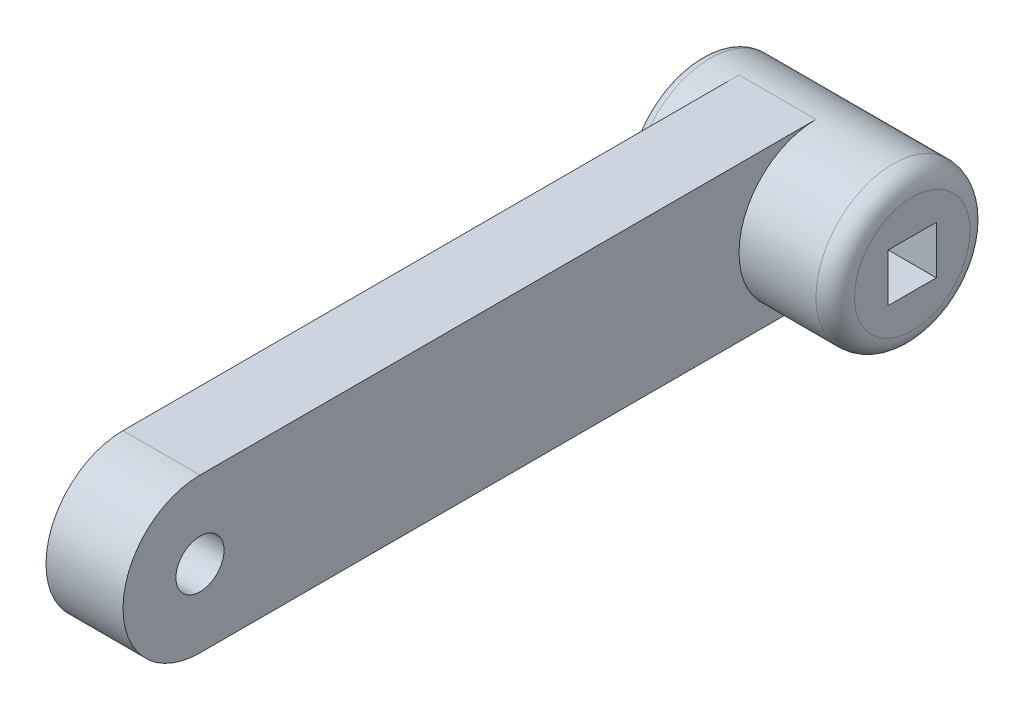
ISO-10303-21;
HEADER;
FILE_DESCRIPTION(('STEP AP214'),'2;1');
FILE_NAME('part.step','',(''),(''),'','','');
FILE_SCHEMA(('AUTOMOTIVE_DESIGN { 1 0 10303 214 1 1 1 1 }'));
ENDSEC;
DATA;
#1=APPLICATION_CONTEXT('core data for automotive mechanical design processes');
#2=APPLICATION_PROTOCOL_DEFINITION('international standard','automotive_design',2000,#1);
#3=PRODUCT_CONTEXT('',#1,'mechanical');
#4=PRODUCT('Part','Part','',(#3));
#5=PRODUCT_RELATED_PRODUCT_CATEGORY('part','',(#4));
#6=PRODUCT_DEFINITION_FORMATION('','',#4);
#7=PRODUCT_DEFINITION_CONTEXT('part definition',#1,'design');
#8=PRODUCT_DEFINITION('design','',#6,#7);
#9=PRODUCT_DEFINITION_SHAPE('','',#8);
#10=(LENGTH_UNIT() NAMED_UNIT(*) SI_UNIT(.MILLI.,.METRE.));
#11=(NAMED_UNIT(*) PLANE_ANGLE_UNIT() SI_UNIT($,.RADIAN.));
#12=(NAMED_UNIT(*) SI_UNIT($,.STERADIAN.) SOLID_ANGLE_UNIT());
#13=UNCERTAINTY_MEASURE_WITH_UNIT(LENGTH_MEASURE(1.E-05),#10,'distance_accuracy_value','');
#14=(GEOMETRIC_REPRESENTATION_CONTEXT(3) GLOBAL_UNCERTAINTY_ASSIGNED_CONTEXT((#13)) GLOBAL_UNIT_ASSIGNED_CONTEXT((#10,
#11,#12)) REPRESENTATION_CONTEXT('',''));
#15=CARTESIAN_POINT('',(0.,0.,0.));
#16=DIRECTION('',(0.,0.,1.));
#17=DIRECTION('',(1.,0.,0.));
#18=AXIS2_PLACEMENT_3D('',#15,#16,#17);
#19=CARTESIAN_POINT('',(10.16,0.,0.));
#20=DIRECTION('',(-1.,0.,0.));
#21=DIRECTION('',(0.,0.,1.));
#22=AXIS2_PLACEMENT_3D('',#19,#20,#21);
#23=CYLINDRICAL_SURFACE('',#22,10.16);
#24=CARTESIAN_POINT('',(15.24,0.,0.));
#25=DIRECTION('',(1.,0.,0.));
#26=DIRECTION('',(0.,0.,-1.));
#27=AXIS2_PLACEMENT_3D('',#24,#25,#26);
#28=CIRCLE('',#27,10.16);
#29=CARTESIAN_POINT('',(15.24,0.,-10.16));
#30=VERTEX_POINT('',#29);
#31=EDGE_CURVE('E11',#30,#30,#28,.F.);
#32=ORIENTED_EDGE('',*,*,#31,.T.);
#33=EDGE_LOOP('',(#32));
#34=FACE_BOUND('',#33,.T.);
#35=CARTESIAN_POINT('',(5.08,0.,0.));
#36=DIRECTION('',(1.,0.,0.));
#37=DIRECTION('',(0.,0.,-1.));
#38=AXIS2_PLACEMENT_3D('',#35,#36,#37);
#39=CIRCLE('',#38,10.16);
#40=CARTESIAN_POINT('',(5.08,10.16,0.));
#41=VERTEX_POINT('',#40);
#42=CARTESIAN_POINT('',(5.08,-10.16,0.));
#43=VERTEX_POINT('',#42);
#44=EDGE_CURVE('E56',#41,#43,#39,.T.);
#45=ORIENTED_EDGE('',*,*,#44,.T.);
#46=DIRECTION('',(-1.,0.,0.));
#47=VECTOR('',#46,1.);
#48=CARTESIAN_POINT('',(5.08,-10.16,0.));
#49=LINE('',#48,#47);
#50=CARTESIAN_POINT('',(-5.08,-10.16,0.));
#51=VERTEX_POINT('',#50);
#52=EDGE_CURVE('E159',#43,#51,#49,.T.);
#53=ORIENTED_EDGE('',*,*,#52,.T.);
#54=CARTESIAN_POINT('',(-5.08,0.,0.));
#55=DIRECTION('',(1.,0.,0.));
#56=DIRECTION('',(0.,0.,-1.));
#57=AXIS2_PLACEMENT_3D('',#54,#55,#56);
#58=CIRCLE('',#57,10.16);
#59=CARTESIAN_POINT('',(-5.08,10.16,0.));
#60=VERTEX_POINT('',#59);
#61=EDGE_CURVE('E170',#60,#51,#58,.T.);
#62=ORIENTED_EDGE('',*,*,#61,.F.);
#63=DIRECTION('',(-1.,0.,0.));
#64=VECTOR('',#63,1.);
#65=CARTESIAN_POINT('',(5.08,10.16,0.));
#66=LINE('',#65,#64);
#67=EDGE_CURVE('E156',#41,#60,#66,.T.);
#68=ORIENTED_EDGE('',*,*,#67,.F.);
#69=EDGE_LOOP('',(#45,#53,#62,#68));
#70=FACE_BOUND('',#69,.T.);
#71=CARTESIAN_POINT('',(-8.89,0.,0.));
#72=DIRECTION('',(1.,0.,0.));
#73=DIRECTION('',(0.,0.,-1.));
#74=AXIS2_PLACEMENT_3D('',#71,#72,#73);
#75=CIRCLE('',#74,10.16);
#76=CARTESIAN_POINT('',(-8.89,0.,-10.16));
#77=VERTEX_POINT('',#76);
#78=EDGE_CURVE('E164',#77,#77,#75,.T.);
#79=ORIENTED_EDGE('',*,*,#78,.T.);
#80=EDGE_LOOP('',(#79));
#81=FACE_BOUND('',#80,.T.);
#82=ADVANCED_FACE('F32',(#34,#70,#81),#23,.T.);
#83=CARTESIAN_POINT('',(-10.16,0.,0.));
#84=DIRECTION('',(1.,0.,0.));
#85=DIRECTION('',(0.,0.,-1.));
#86=AXIS2_PLACEMENT_3D('',#83,#84,#85);
#87=PLANE('',#86);
#88=CARTESIAN_POINT('',(-10.16,0.,0.));
#89=DIRECTION('',(1.,0.,0.));
#90=DIRECTION('',(0.,0.,-1.));
#91=AXIS2_PLACEMENT_3D('',#88,#89,#90);
#92=CIRCLE('',#91,8.89);
#93=CARTESIAN_POINT('',(-10.16,0.,-8.89));
#94=VERTEX_POINT('',#93);
#95=EDGE_CURVE('E167',#94,#94,#92,.F.);
#96=ORIENTED_EDGE('',*,*,#95,.T.);
#97=EDGE_LOOP('',(#96));
#98=FACE_BOUND('',#97,.T.);
#99=ADVANCED_FACE('F192',(#98),#87,.F.);
#100=CARTESIAN_POINT('',(-8.89,0.,0.));
#101=DIRECTION('',(1.,0.,0.));
#102=DIRECTION('',(0.,0.,-1.));
#103=AXIS2_PLACEMENT_3D('',#100,#101,#102);
#104=TOROIDAL_SURFACE('',#103,8.89,1.27);
#105=ORIENTED_EDGE('',*,*,#95,.F.);
#106=EDGE_LOOP('',(#105));
#107=FACE_BOUND('',#106,.T.);
#108=ORIENTED_EDGE('',*,*,#78,.F.);
#109=EDGE_LOOP('',(#108));
#110=FACE_BOUND('',#109,.T.);
#111=ADVANCED_FACE('F198',(#107,#110),#104,.T.);
#112=CARTESIAN_POINT('',(5.08,0.,81.28));
#113=DIRECTION('',(1.,0.,0.));
#114=DIRECTION('',(0.,0.,-1.));
#115=AXIS2_PLACEMENT_3D('',#112,#113,#114);
#116=PLANE('',#115);
#117=CARTESIAN_POINT('',(5.08,0.,81.28));
#118=DIRECTION('',(1.,0.,0.));
#119=DIRECTION('',(0.,0.,-1.));
#120=AXIS2_PLACEMENT_3D('',#117,#118,#119);
#121=CIRCLE('',#120,3.175);
#122=CARTESIAN_POINT('',(5.08,0.,78.105));
#123=VERTEX_POINT('',#122);
#124=EDGE_CURVE('E124',#123,#123,#121,.T.);
#125=ORIENTED_EDGE('',*,*,#124,.F.);
#126=EDGE_LOOP('',(#125));
#127=FACE_BOUND('',#126,.T.);
#128=ORIENTED_EDGE('',*,*,#44,.F.);
#129=DIRECTION('',(0.,0.,1.));
#130=VECTOR('',#129,1.);
#131=CARTESIAN_POINT('',(5.08,10.16,81.28));
#132=LINE('',#131,#130);
#133=CARTESIAN_POINT('',(5.08,10.16,81.28));
#134=VERTEX_POINT('',#133);
#135=EDGE_CURVE('E145',#41,#134,#132,.T.);
#136=ORIENTED_EDGE('',*,*,#135,.T.);
#137=CARTESIAN_POINT('',(5.08,0.,81.28));
#138=DIRECTION('',(1.,0.,0.));
#139=DIRECTION('',(0.,0.,-1.));
#140=AXIS2_PLACEMENT_3D('',#137,#138,#139);
#141=CIRCLE('',#140,10.16);
#142=CARTESIAN_POINT('',(5.08,-10.16,81.28));
#143=VERTEX_POINT('',#142);
#144=EDGE_CURVE('E139',#134,#143,#141,.T.);
#145=ORIENTED_EDGE('',*,*,#144,.T.);
#146=DIRECTION('',(0.,0.,-1.));
#147=VECTOR('',#146,1.);
#148=CARTESIAN_POINT('',(5.08,-10.16,81.28));
#149=LINE('',#148,#147);
#150=EDGE_CURVE('E142',#143,#43,#149,.T.);
#151=ORIENTED_EDGE('',*,*,#150,.T.);
#152=EDGE_LOOP('',(#128,#136,#145,#151));
#153=FACE_BOUND('',#152,.T.);
#154=ADVANCED_FACE('F203',(#127,#153),#116,.T.);
#155=CARTESIAN_POINT('',(-5.08,0.,81.28));
#156=DIRECTION('',(1.,0.,0.));
#157=DIRECTION('',(0.,0.,-1.));
#158=AXIS2_PLACEMENT_3D('',#155,#156,#157);
#159=PLANE('',#158);
#160=CARTESIAN_POINT('',(-5.08,0.,81.28));
#161=DIRECTION('',(1.,0.,0.));
#162=DIRECTION('',(0.,0.,-1.));
#163=AXIS2_PLACEMENT_3D('',#160,#161,#162);
#164=CIRCLE('',#163,3.175);
#165=CARTESIAN_POINT('',(-5.08,0.,78.105));
#166=VERTEX_POINT('',#165);
#167=EDGE_CURVE('E36',#166,#166,#164,.T.);
#168=ORIENTED_EDGE('',*,*,#167,.T.);
#169=EDGE_LOOP('',(#168));
#170=FACE_BOUND('',#169,.T.);
#171=DIRECTION('',(0.,0.,1.));
#172=VECTOR('',#171,1.);
#173=CARTESIAN_POINT('',(-5.08,10.16,81.28));
#174=LINE('',#173,#172);
#175=CARTESIAN_POINT('',(-5.08,10.16,81.28));
#176=VERTEX_POINT('',#175);
#177=EDGE_CURVE('E143',#60,#176,#174,.T.);
#178=ORIENTED_EDGE('',*,*,#177,.F.);
#179=ORIENTED_EDGE('',*,*,#61,.T.);
#180=DIRECTION('',(0.,0.,-1.));
#181=VECTOR('',#180,1.);
#182=CARTESIAN_POINT('',(-5.08,-10.16,81.28));
#183=LINE('',#182,#181);
#184=CARTESIAN_POINT('',(-5.08,-10.16,81.28));
#185=VERTEX_POINT('',#184);
#186=EDGE_CURVE('E150',#185,#51,#183,.T.);
#187=ORIENTED_EDGE('',*,*,#186,.F.);
#188=CARTESIAN_POINT('',(-5.08,0.,81.28));
#189=DIRECTION('',(1.,0.,0.));
#190=DIRECTION('',(0.,0.,-1.));
#191=AXIS2_PLACEMENT_3D('',#188,#189,#190);
#192=CIRCLE('',#191,10.16);
#193=EDGE_CURVE('E135',#176,#185,#192,.T.);
#194=ORIENTED_EDGE('',*,*,#193,.F.);
#195=EDGE_LOOP('',(#178,#179,#187,#194));
#196=FACE_BOUND('',#195,.T.);
#197=ADVANCED_FACE('F208',(#170,#196),#159,.F.);
#198=CARTESIAN_POINT('',(5.08,0.,81.28));
#199=DIRECTION('',(-1.,0.,0.));
#200=DIRECTION('',(0.,0.,1.));
#201=AXIS2_PLACEMENT_3D('',#198,#199,#200);
#202=CYLINDRICAL_SURFACE('',#201,10.16);
#203=ORIENTED_EDGE('',*,*,#193,.T.);
#204=DIRECTION('',(-1.,0.,0.));
#205=VECTOR('',#204,1.);
#206=CARTESIAN_POINT('',(5.08,-10.16,81.28));
#207=LINE('',#206,#205);
#208=EDGE_CURVE('E161',#143,#185,#207,.T.);
#209=ORIENTED_EDGE('',*,*,#208,.F.);
#210=ORIENTED_EDGE('',*,*,#144,.F.);
#211=DIRECTION('',(-1.,0.,0.));
#212=VECTOR('',#211,1.);
#213=CARTESIAN_POINT('',(5.08,10.16,81.28));
#214=LINE('',#213,#212);
#215=EDGE_CURVE('E147',#134,#176,#214,.T.);
#216=ORIENTED_EDGE('',*,*,#215,.T.);
#217=EDGE_LOOP('',(#203,#209,#210,#216));
#218=FACE_BOUND('',#217,.T.);
#219=ADVANCED_FACE('F218',(#218),#202,.T.);
#220=CARTESIAN_POINT('',(5.08,-10.16,81.28));
#221=DIRECTION('',(0.,1.,0.));
#222=DIRECTION('',(0.,0.,1.));
#223=AXIS2_PLACEMENT_3D('',#220,#221,#222);
#224=PLANE('',#223);
#225=ORIENTED_EDGE('',*,*,#186,.T.);
#226=ORIENTED_EDGE('',*,*,#52,.F.);
#227=ORIENTED_EDGE('',*,*,#150,.F.);
#228=ORIENTED_EDGE('',*,*,#208,.T.);
#229=EDGE_LOOP('',(#225,#226,#227,#228));
#230=FACE_BOUND('',#229,.T.);
#231=ADVANCED_FACE('F226',(#230),#224,.F.);
#232=CARTESIAN_POINT('',(5.08,10.16,81.28));
#233=DIRECTION('',(0.,-1.,0.));
#234=DIRECTION('',(0.,0.,-1.));
#235=AXIS2_PLACEMENT_3D('',#232,#233,#234);
#236=PLANE('',#235);
#237=ORIENTED_EDGE('',*,*,#177,.T.);
#238=ORIENTED_EDGE('',*,*,#215,.F.);
#239=ORIENTED_EDGE('',*,*,#135,.F.);
#240=ORIENTED_EDGE('',*,*,#67,.T.);
#241=EDGE_LOOP('',(#237,#238,#239,#240));
#242=FACE_BOUND('',#241,.T.);
#243=ADVANCED_FACE('F187',(#242),#236,.F.);
#244=CARTESIAN_POINT('',(17.78,0.,0.));
#245=DIRECTION('',(1.,0.,0.));
#246=DIRECTION('',(0.,0.,-1.));
#247=AXIS2_PLACEMENT_3D('',#244,#245,#246);
#248=PLANE('',#247);
#249=DIRECTION('',(0.,1.,0.));
#250=VECTOR('',#249,1.);
#251=CARTESIAN_POINT('',(17.78,3.175,-3.175));
#252=LINE('',#251,#250);
#253=CARTESIAN_POINT('',(17.78,-3.175,-3.175));
#254=VERTEX_POINT('',#253);
#255=CARTESIAN_POINT('',(17.78,3.175,-3.175));
#256=VERTEX_POINT('',#255);
#257=EDGE_CURVE('E48',#254,#256,#252,.T.);
#258=ORIENTED_EDGE('',*,*,#257,.F.);
#259=DIRECTION('',(0.,0.,-1.));
#260=VECTOR('',#259,1.);
#261=CARTESIAN_POINT('',(17.78,-3.175,3.175));
#262=LINE('',#261,#260);
#263=CARTESIAN_POINT('',(17.78,-3.175,3.175));
#264=VERTEX_POINT('',#263);
#265=EDGE_CURVE('E118',#264,#254,#262,.T.);
#266=ORIENTED_EDGE('',*,*,#265,.F.);
#267=DIRECTION('',(0.,-1.,0.));
#268=VECTOR('',#267,1.);
#269=CARTESIAN_POINT('',(17.78,3.175,3.175));
#270=LINE('',#269,#268);
#271=CARTESIAN_POINT('',(17.78,3.175,3.175));
#272=VERTEX_POINT('',#271);
#273=EDGE_CURVE('E121',#272,#264,#270,.T.);
#274=ORIENTED_EDGE('',*,*,#273,.F.);
#275=DIRECTION('',(0.,0.,1.));
#276=VECTOR('',#275,1.);
#277=CARTESIAN_POINT('',(17.78,3.175,3.175));
#278=LINE('',#277,#276);
#279=EDGE_CURVE('E129',#256,#272,#278,.T.);
#280=ORIENTED_EDGE('',*,*,#279,.F.);
#281=EDGE_LOOP('',(#258,#266,#274,#280));
#282=FACE_BOUND('',#281,.T.);
#283=CARTESIAN_POINT('',(17.78,0.,0.));
#284=DIRECTION('',(1.,0.,0.));
#285=DIRECTION('',(0.,0.,-1.));
#286=AXIS2_PLACEMENT_3D('',#283,#284,#285);
#287=CIRCLE('',#286,7.62);
#288=CARTESIAN_POINT('',(17.78,0.,-7.62));
#289=VERTEX_POINT('',#288);
#290=EDGE_CURVE('E41',#289,#289,#287,.T.);
#291=ORIENTED_EDGE('',*,*,#290,.T.);
#292=EDGE_LOOP('',(#291));
#293=FACE_BOUND('',#292,.T.);
#294=ADVANCED_FACE('F177',(#282,#293),#248,.T.);
#295=CARTESIAN_POINT('',(15.24,0.,0.));
#296=DIRECTION('',(1.,0.,0.));
#297=DIRECTION('',(0.,0.,-1.));
#298=AXIS2_PLACEMENT_3D('',#295,#296,#297);
#299=TOROIDAL_SURFACE('',#298,7.62,2.54);
#300=ORIENTED_EDGE('',*,*,#31,.F.);
#301=EDGE_LOOP('',(#300));
#302=FACE_BOUND('',#301,.T.);
#303=ORIENTED_EDGE('',*,*,#290,.F.);
#304=EDGE_LOOP('',(#303));
#305=FACE_BOUND('',#304,.T.);
#306=ADVANCED_FACE('F34',(#302,#305),#299,.T.);
#307=CARTESIAN_POINT('',(-7.62,3.175,-3.175));
#308=DIRECTION('',(0.,0.,-1.));
#309=DIRECTION('',(0.,1.,0.));
#310=AXIS2_PLACEMENT_3D('',#307,#308,#309);
#311=PLANE('',#310);
#312=ORIENTED_EDGE('',*,*,#257,.T.);
#313=DIRECTION('',(1.,0.,0.));
#314=VECTOR('',#313,1.);
#315=CARTESIAN_POINT('',(-7.62,3.175,-3.175));
#316=LINE('',#315,#314);
#317=CARTESIAN_POINT('',(-7.62,3.175,-3.175));
#318=VERTEX_POINT('',#317);
#319=EDGE_CURVE('E96',#318,#256,#316,.T.);
#320=ORIENTED_EDGE('',*,*,#319,.F.);
#321=DIRECTION('',(0.,1.,0.));
#322=VECTOR('',#321,1.);
#323=CARTESIAN_POINT('',(-7.62,3.175,-3.175));
#324=LINE('',#323,#322);
#325=CARTESIAN_POINT('',(-7.62,-3.175,-3.175));
#326=VERTEX_POINT('',#325);
#327=EDGE_CURVE('E100',#326,#318,#324,.T.);
#328=ORIENTED_EDGE('',*,*,#327,.F.);
#329=DIRECTION('',(1.,0.,0.));
#330=VECTOR('',#329,1.);
#331=CARTESIAN_POINT('',(-7.62,-3.175,-3.175));
#332=LINE('',#331,#330);
#333=EDGE_CURVE('E133',#326,#254,#332,.T.);
#334=ORIENTED_EDGE('',*,*,#333,.T.);
#335=EDGE_LOOP('',(#312,#320,#328,#334));
#336=FACE_BOUND('',#335,.T.);
#337=ADVANCED_FACE('F98',(#336),#311,.F.);
#338=CARTESIAN_POINT('',(-7.62,-3.175,3.175));
#339=DIRECTION('',(0.,-1.,0.));
#340=DIRECTION('',(0.,0.,-1.));
#341=AXIS2_PLACEMENT_3D('',#338,#339,#340);
#342=PLANE('',#341);
#343=ORIENTED_EDGE('',*,*,#265,.T.);
#344=ORIENTED_EDGE('',*,*,#333,.F.);
#345=DIRECTION('',(0.,0.,-1.));
#346=VECTOR('',#345,1.);
#347=CARTESIAN_POINT('',(-7.62,-3.175,3.175));
#348=LINE('',#347,#346);
#349=CARTESIAN_POINT('',(-7.62,-3.175,3.175));
#350=VERTEX_POINT('',#349);
#351=EDGE_CURVE('E106',#350,#326,#348,.T.);
#352=ORIENTED_EDGE('',*,*,#351,.F.);
#353=DIRECTION('',(1.,0.,0.));
#354=VECTOR('',#353,1.);
#355=CARTESIAN_POINT('',(-7.62,-3.175,3.175));
#356=LINE('',#355,#354);
#357=EDGE_CURVE('E136',#350,#264,#356,.T.);
#358=ORIENTED_EDGE('',*,*,#357,.T.);
#359=EDGE_LOOP('',(#343,#344,#352,#358));
#360=FACE_BOUND('',#359,.T.);
#361=ADVANCED_FACE('F185',(#360),#342,.F.);
#362=CARTESIAN_POINT('',(-7.62,3.175,3.175));
#363=DIRECTION('',(0.,0.,1.));
#364=DIRECTION('',(0.,-1.,0.));
#365=AXIS2_PLACEMENT_3D('',#362,#363,#364);
#366=PLANE('',#365);
#367=ORIENTED_EDGE('',*,*,#273,.T.);
#368=ORIENTED_EDGE('',*,*,#357,.F.);
#369=DIRECTION('',(0.,-1.,0.));
#370=VECTOR('',#369,1.);
#371=CARTESIAN_POINT('',(-7.62,3.175,3.175));
#372=LINE('',#371,#370);
#373=CARTESIAN_POINT('',(-7.62,3.175,3.175));
#374=VERTEX_POINT('',#373);
#375=EDGE_CURVE('E114',#374,#350,#372,.T.);
#376=ORIENTED_EDGE('',*,*,#375,.F.);
#377=DIRECTION('',(1.,0.,0.));
#378=VECTOR('',#377,1.);
#379=CARTESIAN_POINT('',(-7.62,3.175,3.175));
#380=LINE('',#379,#378);
#381=EDGE_CURVE('E105',#374,#272,#380,.T.);
#382=ORIENTED_EDGE('',*,*,#381,.T.);
#383=EDGE_LOOP('',(#367,#368,#376,#382));
#384=FACE_BOUND('',#383,.T.);
#385=ADVANCED_FACE('F274',(#384),#366,.F.);
#386=CARTESIAN_POINT('',(-7.62,3.175,3.175));
#387=DIRECTION('',(0.,1.,0.));
#388=DIRECTION('',(0.,0.,1.));
#389=AXIS2_PLACEMENT_3D('',#386,#387,#388);
#390=PLANE('',#389);
#391=ORIENTED_EDGE('',*,*,#279,.T.);
#392=ORIENTED_EDGE('',*,*,#381,.F.);
#393=DIRECTION('',(0.,0.,1.));
#394=VECTOR('',#393,1.);
#395=CARTESIAN_POINT('',(-7.62,3.175,3.175));
#396=LINE('',#395,#394);
#397=EDGE_CURVE('E109',#318,#374,#396,.T.);
#398=ORIENTED_EDGE('',*,*,#397,.F.);
#399=ORIENTED_EDGE('',*,*,#319,.T.);
#400=EDGE_LOOP('',(#391,#392,#398,#399));
#401=FACE_BOUND('',#400,.T.);
#402=ADVANCED_FACE('F110',(#401),#390,.F.);
#403=CARTESIAN_POINT('',(-7.62,0.,0.));
#404=DIRECTION('',(1.,0.,0.));
#405=DIRECTION('',(0.,0.,-1.));
#406=AXIS2_PLACEMENT_3D('',#403,#404,#405);
#407=PLANE('',#406);
#408=ORIENTED_EDGE('',*,*,#327,.T.);
#409=ORIENTED_EDGE('',*,*,#397,.T.);
#410=ORIENTED_EDGE('',*,*,#375,.T.);
#411=ORIENTED_EDGE('',*,*,#351,.T.);
#412=EDGE_LOOP('',(#408,#409,#410,#411));
#413=FACE_BOUND('',#412,.T.);
#414=ADVANCED_FACE('F116',(#413),#407,.T.);
#415=CARTESIAN_POINT('',(-10.16,0.,81.28));
#416=DIRECTION('',(1.,0.,0.));
#417=DIRECTION('',(0.,0.,-1.));
#418=AXIS2_PLACEMENT_3D('',#415,#416,#417);
#419=CYLINDRICAL_SURFACE('',#418,3.175);
#420=ORIENTED_EDGE('',*,*,#124,.T.);
#421=EDGE_LOOP('',(#420));
#422=FACE_BOUND('',#421,.T.);
#423=ORIENTED_EDGE('',*,*,#167,.F.);
#424=EDGE_LOOP('',(#423));
#425=FACE_BOUND('',#424,.T.);
#426=ADVANCED_FACE('F300',(#422,#425),#419,.F.);
#427=CLOSED_SHELL('',(#82,#99,#111,#154,#197,#219,#231,#243,#294,#306,#337,#361,#385,#402,#414,#426));
#428=MANIFOLD_SOLID_BREP('B2',#427);
#429=ADVANCED_BREP_SHAPE_REPRESENTATION('',(#18,#428),#14);
#430=SHAPE_DEFINITION_REPRESENTATION(#9,#429);
ENDSEC;
END-ISO-10303-21;
